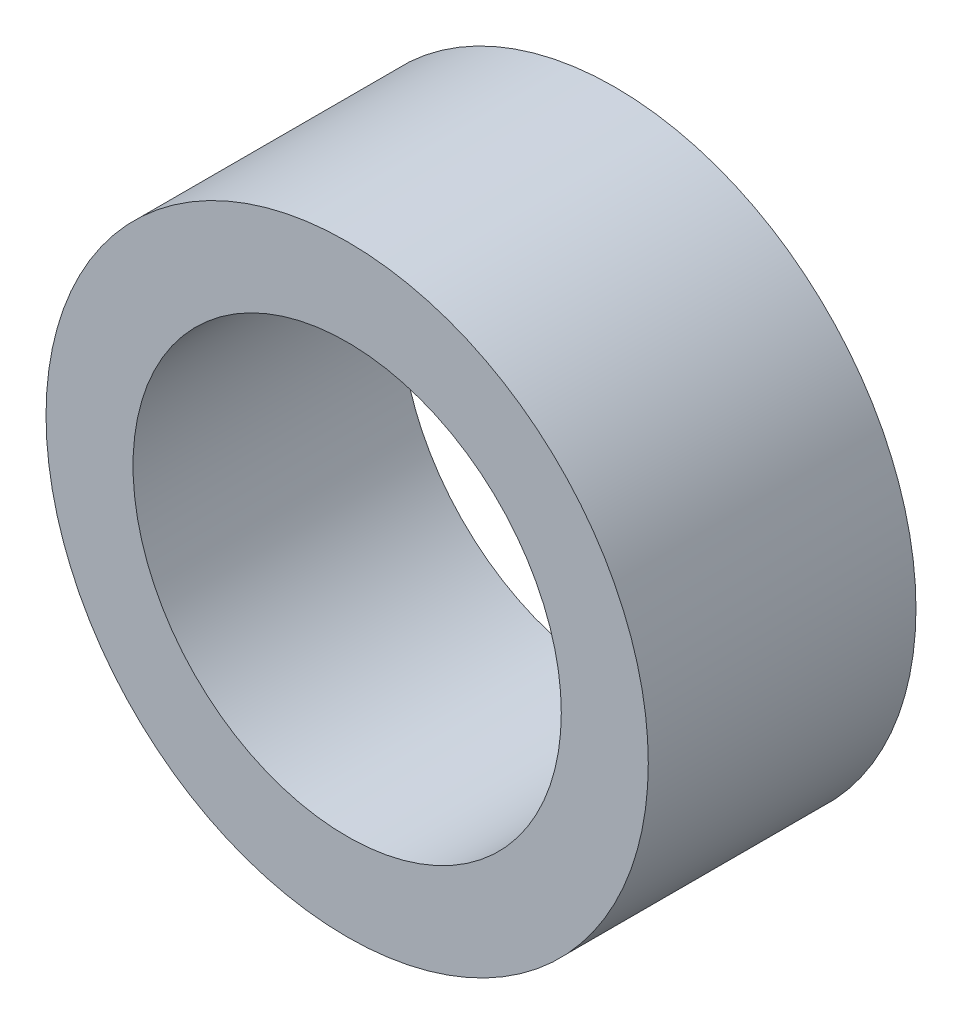
ISO-10303-21;
HEADER;
FILE_DESCRIPTION(('STEP AP214'),'2;1');
FILE_NAME('part.step','',(''),(''),'','','');
FILE_SCHEMA(('AUTOMOTIVE_DESIGN { 1 0 10303 214 1 1 1 1 }'));
ENDSEC;
DATA;
#1=APPLICATION_CONTEXT('core data for automotive mechanical design processes');
#2=APPLICATION_PROTOCOL_DEFINITION('international standard','automotive_design',2000,#1);
#3=PRODUCT_CONTEXT('',#1,'mechanical');
#4=PRODUCT('Part','Part','',(#3));
#5=PRODUCT_RELATED_PRODUCT_CATEGORY('part','',(#4));
#6=PRODUCT_DEFINITION_FORMATION('','',#4);
#7=PRODUCT_DEFINITION_CONTEXT('part definition',#1,'design');
#8=PRODUCT_DEFINITION('design','',#6,#7);
#9=PRODUCT_DEFINITION_SHAPE('','',#8);
#10=(LENGTH_UNIT() NAMED_UNIT(*) SI_UNIT(.MILLI.,.METRE.));
#11=(NAMED_UNIT(*) PLANE_ANGLE_UNIT() SI_UNIT($,.RADIAN.));
#12=(NAMED_UNIT(*) SI_UNIT($,.STERADIAN.) SOLID_ANGLE_UNIT());
#13=UNCERTAINTY_MEASURE_WITH_UNIT(LENGTH_MEASURE(1.E-05),#10,'distance_accuracy_value','');
#14=(GEOMETRIC_REPRESENTATION_CONTEXT(3) GLOBAL_UNCERTAINTY_ASSIGNED_CONTEXT((#13)) GLOBAL_UNIT_ASSIGNED_CONTEXT((#10,
#11,#12)) REPRESENTATION_CONTEXT('',''));
#15=CARTESIAN_POINT('',(0.,0.,0.));
#16=DIRECTION('',(0.,0.,1.));
#17=DIRECTION('',(1.,0.,0.));
#18=AXIS2_PLACEMENT_3D('',#15,#16,#17);
#19=CARTESIAN_POINT('',(0.,0.,1.));
#20=DIRECTION('',(0.,0.,1.));
#21=DIRECTION('',(1.,0.,0.));
#22=AXIS2_PLACEMENT_3D('',#19,#20,#21);
#23=PLANE('',#22);
#24=CARTESIAN_POINT('',(0.,0.,1.));
#25=DIRECTION('',(0.,0.,1.));
#26=DIRECTION('',(1.,0.,0.));
#27=AXIS2_PLACEMENT_3D('',#24,#25,#26);
#28=CIRCLE('',#27,2.25);
#29=CARTESIAN_POINT('',(2.25,0.,1.));
#30=VERTEX_POINT('',#29);
#31=EDGE_CURVE('E10',#30,#30,#28,.T.);
#32=ORIENTED_EDGE('',*,*,#31,.T.);
#33=EDGE_LOOP('',(#32));
#34=FACE_BOUND('',#33,.T.);
#35=CARTESIAN_POINT('',(0.,0.,1.));
#36=DIRECTION('',(0.,0.,1.));
#37=DIRECTION('',(1.,0.,0.));
#38=AXIS2_PLACEMENT_3D('',#35,#36,#37);
#39=CIRCLE('',#38,1.6);
#40=CARTESIAN_POINT('',(1.6,0.,1.));
#41=VERTEX_POINT('',#40);
#42=EDGE_CURVE('E41',#41,#41,#39,.T.);
#43=ORIENTED_EDGE('',*,*,#42,.F.);
#44=EDGE_LOOP('',(#43));
#45=FACE_BOUND('',#44,.T.);
#46=ADVANCED_FACE('F30',(#34,#45),#23,.T.);
#47=CARTESIAN_POINT('',(0.,0.,-1.));
#48=DIRECTION('',(0.,0.,1.));
#49=DIRECTION('',(1.,0.,0.));
#50=AXIS2_PLACEMENT_3D('',#47,#48,#49);
#51=PLANE('',#50);
#52=CARTESIAN_POINT('',(0.,0.,-1.));
#53=DIRECTION('',(0.,0.,1.));
#54=DIRECTION('',(1.,0.,0.));
#55=AXIS2_PLACEMENT_3D('',#52,#53,#54);
#56=CIRCLE('',#55,2.25);
#57=CARTESIAN_POINT('',(2.25,0.,-1.));
#58=VERTEX_POINT('',#57);
#59=EDGE_CURVE('E34',#58,#58,#56,.T.);
#60=ORIENTED_EDGE('',*,*,#59,.F.);
#61=EDGE_LOOP('',(#60));
#62=FACE_BOUND('',#61,.T.);
#63=CARTESIAN_POINT('',(0.,0.,-1.));
#64=DIRECTION('',(0.,0.,1.));
#65=DIRECTION('',(1.,0.,0.));
#66=AXIS2_PLACEMENT_3D('',#63,#64,#65);
#67=CIRCLE('',#66,1.6);
#68=CARTESIAN_POINT('',(1.6,0.,-1.));
#69=VERTEX_POINT('',#68);
#70=EDGE_CURVE('E43',#69,#69,#67,.T.);
#71=ORIENTED_EDGE('',*,*,#70,.T.);
#72=EDGE_LOOP('',(#71));
#73=FACE_BOUND('',#72,.T.);
#74=ADVANCED_FACE('F53',(#62,#73),#51,.F.);
#75=CARTESIAN_POINT('',(0.,0.,1.));
#76=DIRECTION('',(0.,0.,-1.));
#77=DIRECTION('',(-1.,0.,0.));
#78=AXIS2_PLACEMENT_3D('',#75,#76,#77);
#79=CYLINDRICAL_SURFACE('',#78,2.25);
#80=ORIENTED_EDGE('',*,*,#31,.F.);
#81=EDGE_LOOP('',(#80));
#82=FACE_BOUND('',#81,.T.);
#83=ORIENTED_EDGE('',*,*,#59,.T.);
#84=EDGE_LOOP('',(#83));
#85=FACE_BOUND('',#84,.T.);
#86=ADVANCED_FACE('F32',(#82,#85),#79,.T.);
#87=CARTESIAN_POINT('',(0.,0.,1.));
#88=DIRECTION('',(0.,0.,-1.));
#89=DIRECTION('',(-1.,0.,0.));
#90=AXIS2_PLACEMENT_3D('',#87,#88,#89);
#91=CYLINDRICAL_SURFACE('',#90,1.6);
#92=ORIENTED_EDGE('',*,*,#42,.T.);
#93=EDGE_LOOP('',(#92));
#94=FACE_BOUND('',#93,.T.);
#95=ORIENTED_EDGE('',*,*,#70,.F.);
#96=EDGE_LOOP('',(#95));
#97=FACE_BOUND('',#96,.T.);
#98=ADVANCED_FACE('F49',(#94,#97),#91,.F.);
#99=CLOSED_SHELL('',(#46,#74,#86,#98));
#100=MANIFOLD_SOLID_BREP('B2',#99);
#101=ADVANCED_BREP_SHAPE_REPRESENTATION('',(#18,#100),#14);
#102=SHAPE_DEFINITION_REPRESENTATION(#9,#101);
ENDSEC;
END-ISO-10303-21;
